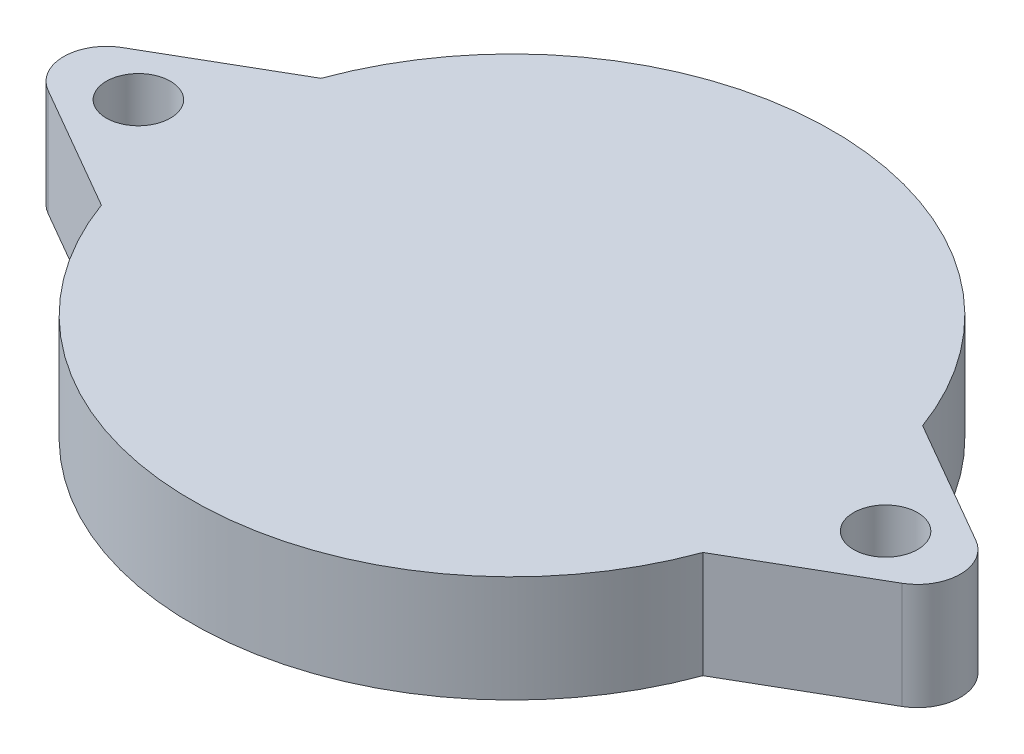
ISO-10303-21;
HEADER;
FILE_DESCRIPTION(('STEP AP214'),'2;1');
FILE_NAME('part.step','',(''),(''),'','','');
FILE_SCHEMA(('AUTOMOTIVE_DESIGN { 1 0 10303 214 1 1 1 1 }'));
ENDSEC;
DATA;
#1=APPLICATION_CONTEXT('core data for automotive mechanical design processes');
#2=APPLICATION_PROTOCOL_DEFINITION('international standard','automotive_design',2000,#1);
#3=PRODUCT_CONTEXT('',#1,'mechanical');
#4=PRODUCT('Part','Part','',(#3));
#5=PRODUCT_RELATED_PRODUCT_CATEGORY('part','',(#4));
#6=PRODUCT_DEFINITION_FORMATION('','',#4);
#7=PRODUCT_DEFINITION_CONTEXT('part definition',#1,'design');
#8=PRODUCT_DEFINITION('design','',#6,#7);
#9=PRODUCT_DEFINITION_SHAPE('','',#8);
#10=(LENGTH_UNIT() NAMED_UNIT(*) SI_UNIT(.MILLI.,.METRE.));
#11=(NAMED_UNIT(*) PLANE_ANGLE_UNIT() SI_UNIT($,.RADIAN.));
#12=(NAMED_UNIT(*) SI_UNIT($,.STERADIAN.) SOLID_ANGLE_UNIT());
#13=UNCERTAINTY_MEASURE_WITH_UNIT(LENGTH_MEASURE(1.E-05),#10,'distance_accuracy_value','');
#14=(GEOMETRIC_REPRESENTATION_CONTEXT(3) GLOBAL_UNCERTAINTY_ASSIGNED_CONTEXT((#13)) GLOBAL_UNIT_ASSIGNED_CONTEXT((#10,
#11,#12)) REPRESENTATION_CONTEXT('',''));
#15=CARTESIAN_POINT('',(0.,0.,0.));
#16=DIRECTION('',(0.,0.,1.));
#17=DIRECTION('',(1.,0.,0.));
#18=AXIS2_PLACEMENT_3D('',#15,#16,#17);
#19=CARTESIAN_POINT('',(0.,5.,0.));
#20=DIRECTION('',(0.,-1.,0.));
#21=DIRECTION('',(0.,0.,-1.));
#22=AXIS2_PLACEMENT_3D('',#19,#20,#21);
#23=CYLINDRICAL_SURFACE('',#22,15.);
#24=CARTESIAN_POINT('',(0.,0.,0.));
#25=DIRECTION('',(0.,1.,0.));
#26=DIRECTION('',(0.,0.,1.));
#27=AXIS2_PLACEMENT_3D('',#24,#25,#26);
#28=CIRCLE('',#27,15.);
#29=CARTESIAN_POINT('',(-14.0904136588062,0.,5.14395207245649));
#30=VERTEX_POINT('',#29);
#31=CARTESIAN_POINT('',(14.0904136588062,0.,5.14395207245648));
#32=VERTEX_POINT('',#31);
#33=EDGE_CURVE('E141',#30,#32,#28,.T.);
#34=ORIENTED_EDGE('',*,*,#33,.T.);
#35=DIRECTION('',(0.,-1.,0.));
#36=VECTOR('',#35,1.);
#37=CARTESIAN_POINT('',(14.0904136588062,5.,5.14395207245648));
#38=LINE('',#37,#36);
#39=CARTESIAN_POINT('',(14.0904136588062,5.,5.14395207245648));
#40=VERTEX_POINT('',#39);
#41=EDGE_CURVE('E11',#40,#32,#38,.T.);
#42=ORIENTED_EDGE('',*,*,#41,.F.);
#43=CARTESIAN_POINT('',(0.,5.,0.));
#44=DIRECTION('',(0.,1.,0.));
#45=DIRECTION('',(0.,0.,1.));
#46=AXIS2_PLACEMENT_3D('',#43,#44,#45);
#47=CIRCLE('',#46,15.);
#48=CARTESIAN_POINT('',(-14.0904136588062,5.,5.14395207245649));
#49=VERTEX_POINT('',#48);
#50=EDGE_CURVE('E165',#49,#40,#47,.T.);
#51=ORIENTED_EDGE('',*,*,#50,.F.);
#52=DIRECTION('',(0.,-1.,0.));
#53=VECTOR('',#52,1.);
#54=CARTESIAN_POINT('',(-14.0904136588062,5.,5.14395207245649));
#55=LINE('',#54,#53);
#56=EDGE_CURVE('E52',#49,#30,#55,.T.);
#57=ORIENTED_EDGE('',*,*,#56,.T.);
#58=EDGE_LOOP('',(#34,#42,#51,#57));
#59=FACE_BOUND('',#58,.T.);
#60=ADVANCED_FACE('F35',(#59),#23,.T.);
#61=CARTESIAN_POINT('',(5.74999999999998,5.,9.95929214352105));
#62=DIRECTION('',(-0.499999999999999,0.,-0.866025403784439));
#63=DIRECTION('',(-0.866025403784439,0.,0.499999999999999));
#64=AXIS2_PLACEMENT_3D('',#61,#62,#63);
#65=PLANE('',#64);
#66=DIRECTION('',(0.866025403784439,0.,-0.499999999999999));
#67=VECTOR('',#66,1.);
#68=CARTESIAN_POINT('',(5.74999999999998,0.,9.95929214352105));
#69=LINE('',#68,#67);
#70=CARTESIAN_POINT('',(20.,0.,1.73205080756888));
#71=VERTEX_POINT('',#70);
#72=EDGE_CURVE('E143',#32,#71,#69,.T.);
#73=ORIENTED_EDGE('',*,*,#72,.T.);
#74=DIRECTION('',(0.,-1.,0.));
#75=VECTOR('',#74,1.);
#76=CARTESIAN_POINT('',(20.,5.,1.73205080756888));
#77=LINE('',#76,#75);
#78=CARTESIAN_POINT('',(20.,5.,1.73205080756888));
#79=VERTEX_POINT('',#78);
#80=EDGE_CURVE('E44',#79,#71,#77,.T.);
#81=ORIENTED_EDGE('',*,*,#80,.F.);
#82=DIRECTION('',(0.866025403784439,0.,-0.499999999999999));
#83=VECTOR('',#82,1.);
#84=CARTESIAN_POINT('',(5.74999999999998,5.,9.95929214352105));
#85=LINE('',#84,#83);
#86=EDGE_CURVE('E91',#40,#79,#85,.T.);
#87=ORIENTED_EDGE('',*,*,#86,.F.);
#88=ORIENTED_EDGE('',*,*,#41,.T.);
#89=EDGE_LOOP('',(#73,#81,#87,#88));
#90=FACE_BOUND('',#89,.T.);
#91=ADVANCED_FACE('F37',(#90),#65,.F.);
#92=CARTESIAN_POINT('',(19.,5.,0.));
#93=DIRECTION('',(0.,-1.,0.));
#94=DIRECTION('',(0.,0.,-1.));
#95=AXIS2_PLACEMENT_3D('',#92,#93,#94);
#96=CYLINDRICAL_SURFACE('',#95,2.00000000000001);
#97=CARTESIAN_POINT('',(19.,0.,0.));
#98=DIRECTION('',(0.,1.,0.));
#99=DIRECTION('',(0.,0.,1.));
#100=AXIS2_PLACEMENT_3D('',#97,#98,#99);
#101=CIRCLE('',#100,2.00000000000001);
#102=CARTESIAN_POINT('',(20.,0.,-1.73205080756888));
#103=VERTEX_POINT('',#102);
#104=EDGE_CURVE('E147',#103,#71,#101,.F.);
#105=ORIENTED_EDGE('',*,*,#104,.F.);
#106=DIRECTION('',(0.,-1.,0.));
#107=VECTOR('',#106,1.);
#108=CARTESIAN_POINT('',(20.,5.,-1.73205080756888));
#109=LINE('',#108,#107);
#110=CARTESIAN_POINT('',(20.,5.,-1.73205080756888));
#111=VERTEX_POINT('',#110);
#112=EDGE_CURVE('E171',#111,#103,#109,.T.);
#113=ORIENTED_EDGE('',*,*,#112,.F.);
#114=CARTESIAN_POINT('',(19.,5.,0.));
#115=DIRECTION('',(0.,1.,0.));
#116=DIRECTION('',(0.,0.,1.));
#117=AXIS2_PLACEMENT_3D('',#114,#115,#116);
#118=CIRCLE('',#117,2.00000000000001);
#119=EDGE_CURVE('E177',#111,#79,#118,.F.);
#120=ORIENTED_EDGE('',*,*,#119,.T.);
#121=ORIENTED_EDGE('',*,*,#80,.T.);
#122=EDGE_LOOP('',(#105,#113,#120,#121));
#123=FACE_BOUND('',#122,.T.);
#124=ADVANCED_FACE('F175',(#123),#96,.T.);
#125=CARTESIAN_POINT('',(5.74999999999998,5.,-9.95929214352105));
#126=DIRECTION('',(0.499999999999999,0.,-0.866025403784439));
#127=DIRECTION('',(-0.866025403784439,0.,-0.499999999999999));
#128=AXIS2_PLACEMENT_3D('',#125,#126,#127);
#129=PLANE('',#128);
#130=DIRECTION('',(0.866025403784439,0.,0.499999999999999));
#131=VECTOR('',#130,1.);
#132=CARTESIAN_POINT('',(5.74999999999998,0.,-9.95929214352105));
#133=LINE('',#132,#131);
#134=CARTESIAN_POINT('',(14.0904136588062,0.,-5.14395207245648));
#135=VERTEX_POINT('',#134);
#136=EDGE_CURVE('E150',#135,#103,#133,.T.);
#137=ORIENTED_EDGE('',*,*,#136,.F.);
#138=DIRECTION('',(0.,-1.,0.));
#139=VECTOR('',#138,1.);
#140=CARTESIAN_POINT('',(14.0904136588062,5.,-5.14395207245648));
#141=LINE('',#140,#139);
#142=CARTESIAN_POINT('',(14.0904136588062,5.,-5.14395207245648));
#143=VERTEX_POINT('',#142);
#144=EDGE_CURVE('E169',#143,#135,#141,.T.);
#145=ORIENTED_EDGE('',*,*,#144,.F.);
#146=DIRECTION('',(0.866025403784439,0.,0.499999999999999));
#147=VECTOR('',#146,1.);
#148=CARTESIAN_POINT('',(5.74999999999998,5.,-9.95929214352105));
#149=LINE('',#148,#147);
#150=EDGE_CURVE('E187',#143,#111,#149,.T.);
#151=ORIENTED_EDGE('',*,*,#150,.T.);
#152=ORIENTED_EDGE('',*,*,#112,.T.);
#153=EDGE_LOOP('',(#137,#145,#151,#152));
#154=FACE_BOUND('',#153,.T.);
#155=ADVANCED_FACE('F185',(#154),#129,.T.);
#156=CARTESIAN_POINT('',(-14.0904136588062,0.,-5.14395207245649));
#157=VERTEX_POINT('',#156);
#158=EDGE_CURVE('E144',#135,#157,#28,.T.);
#159=ORIENTED_EDGE('',*,*,#158,.T.);
#160=DIRECTION('',(0.,-1.,0.));
#161=VECTOR('',#160,1.);
#162=CARTESIAN_POINT('',(-14.0904136588062,5.,-5.14395207245649));
#163=LINE('',#162,#161);
#164=CARTESIAN_POINT('',(-14.0904136588062,5.,-5.14395207245649));
#165=VERTEX_POINT('',#164);
#166=EDGE_CURVE('E127',#165,#157,#163,.T.);
#167=ORIENTED_EDGE('',*,*,#166,.F.);
#168=EDGE_CURVE('E115',#143,#165,#47,.T.);
#169=ORIENTED_EDGE('',*,*,#168,.F.);
#170=ORIENTED_EDGE('',*,*,#144,.T.);
#171=EDGE_LOOP('',(#159,#167,#169,#170));
#172=FACE_BOUND('',#171,.T.);
#173=ADVANCED_FACE('F207',(#172),#23,.T.);
#174=CARTESIAN_POINT('',(-5.74999999999999,5.,-9.95929214352104));
#175=DIRECTION('',(0.5,0.,0.866025403784439));
#176=DIRECTION('',(0.866025403784439,0.,-0.5));
#177=AXIS2_PLACEMENT_3D('',#174,#175,#176);
#178=PLANE('',#177);
#179=DIRECTION('',(-0.866025403784439,0.,0.5));
#180=VECTOR('',#179,1.);
#181=CARTESIAN_POINT('',(-5.74999999999999,0.,-9.95929214352104));
#182=LINE('',#181,#180);
#183=CARTESIAN_POINT('',(-20.,0.,-1.73205080756888));
#184=VERTEX_POINT('',#183);
#185=EDGE_CURVE('E124',#157,#184,#182,.T.);
#186=ORIENTED_EDGE('',*,*,#185,.T.);
#187=DIRECTION('',(0.,-1.,0.));
#188=VECTOR('',#187,1.);
#189=CARTESIAN_POINT('',(-20.,5.,-1.73205080756888));
#190=LINE('',#189,#188);
#191=CARTESIAN_POINT('',(-20.,5.,-1.73205080756888));
#192=VERTEX_POINT('',#191);
#193=EDGE_CURVE('E121',#192,#184,#190,.T.);
#194=ORIENTED_EDGE('',*,*,#193,.F.);
#195=DIRECTION('',(-0.866025403784439,0.,0.5));
#196=VECTOR('',#195,1.);
#197=CARTESIAN_POINT('',(-5.74999999999999,5.,-9.95929214352104));
#198=LINE('',#197,#196);
#199=EDGE_CURVE('E106',#165,#192,#198,.T.);
#200=ORIENTED_EDGE('',*,*,#199,.F.);
#201=ORIENTED_EDGE('',*,*,#166,.T.);
#202=EDGE_LOOP('',(#186,#194,#200,#201));
#203=FACE_BOUND('',#202,.T.);
#204=ADVANCED_FACE('F122',(#203),#178,.F.);
#205=CARTESIAN_POINT('',(-19.,5.,0.));
#206=DIRECTION('',(0.,-1.,0.));
#207=DIRECTION('',(0.,0.,-1.));
#208=AXIS2_PLACEMENT_3D('',#205,#206,#207);
#209=CYLINDRICAL_SURFACE('',#208,2.);
#210=CARTESIAN_POINT('',(-19.,0.,0.));
#211=DIRECTION('',(0.,1.,0.));
#212=DIRECTION('',(0.,0.,1.));
#213=AXIS2_PLACEMENT_3D('',#210,#211,#212);
#214=CIRCLE('',#213,2.);
#215=CARTESIAN_POINT('',(-20.,0.,1.73205080756888));
#216=VERTEX_POINT('',#215);
#217=EDGE_CURVE('E154',#184,#216,#214,.T.);
#218=ORIENTED_EDGE('',*,*,#217,.T.);
#219=DIRECTION('',(0.,-1.,0.));
#220=VECTOR('',#219,1.);
#221=CARTESIAN_POINT('',(-20.,5.,1.73205080756888));
#222=LINE('',#221,#220);
#223=CARTESIAN_POINT('',(-20.,5.,1.73205080756888));
#224=VERTEX_POINT('',#223);
#225=EDGE_CURVE('E79',#224,#216,#222,.T.);
#226=ORIENTED_EDGE('',*,*,#225,.F.);
#227=CARTESIAN_POINT('',(-19.,5.,0.));
#228=DIRECTION('',(0.,1.,0.));
#229=DIRECTION('',(0.,0.,1.));
#230=AXIS2_PLACEMENT_3D('',#227,#228,#229);
#231=CIRCLE('',#230,2.);
#232=EDGE_CURVE('E112',#192,#224,#231,.T.);
#233=ORIENTED_EDGE('',*,*,#232,.F.);
#234=ORIENTED_EDGE('',*,*,#193,.T.);
#235=EDGE_LOOP('',(#218,#226,#233,#234));
#236=FACE_BOUND('',#235,.T.);
#237=ADVANCED_FACE('F129',(#236),#209,.T.);
#238=CARTESIAN_POINT('',(-17.5,5.,0.));
#239=DIRECTION('',(0.,-1.,0.));
#240=DIRECTION('',(0.,0.,-1.));
#241=AXIS2_PLACEMENT_3D('',#238,#239,#240);
#242=CYLINDRICAL_SURFACE('',#241,1.5);
#243=CARTESIAN_POINT('',(-17.5,5.,0.));
#244=DIRECTION('',(0.,1.,0.));
#245=DIRECTION('',(0.,0.,1.));
#246=AXIS2_PLACEMENT_3D('',#243,#244,#245);
#247=CIRCLE('',#246,1.5);
#248=CARTESIAN_POINT('',(-17.5,5.,1.5));
#249=VERTEX_POINT('',#248);
#250=EDGE_CURVE('E132',#249,#249,#247,.T.);
#251=ORIENTED_EDGE('',*,*,#250,.T.);
#252=EDGE_LOOP('',(#251));
#253=FACE_BOUND('',#252,.T.);
#254=CARTESIAN_POINT('',(-17.5,0.,0.));
#255=DIRECTION('',(0.,1.,0.));
#256=DIRECTION('',(0.,0.,1.));
#257=AXIS2_PLACEMENT_3D('',#254,#255,#256);
#258=CIRCLE('',#257,1.5);
#259=CARTESIAN_POINT('',(-17.5,0.,1.5));
#260=VERTEX_POINT('',#259);
#261=EDGE_CURVE('E159',#260,#260,#258,.T.);
#262=ORIENTED_EDGE('',*,*,#261,.F.);
#263=EDGE_LOOP('',(#262));
#264=FACE_BOUND('',#263,.T.);
#265=ADVANCED_FACE('F194',(#253,#264),#242,.F.);
#266=CARTESIAN_POINT('',(-5.74999999999999,5.,9.95929214352104));
#267=DIRECTION('',(-0.5,0.,0.866025403784439));
#268=DIRECTION('',(0.866025403784439,0.,0.5));
#269=AXIS2_PLACEMENT_3D('',#266,#267,#268);
#270=PLANE('',#269);
#271=DIRECTION('',(-0.866025403784439,0.,-0.5));
#272=VECTOR('',#271,1.);
#273=CARTESIAN_POINT('',(-5.74999999999999,0.,9.95929214352104));
#274=LINE('',#273,#272);
#275=EDGE_CURVE('E156',#30,#216,#274,.T.);
#276=ORIENTED_EDGE('',*,*,#275,.F.);
#277=ORIENTED_EDGE('',*,*,#56,.F.);
#278=DIRECTION('',(-0.866025403784439,0.,-0.5));
#279=VECTOR('',#278,1.);
#280=CARTESIAN_POINT('',(-5.74999999999999,5.,9.95929214352104));
#281=LINE('',#280,#279);
#282=EDGE_CURVE('E130',#49,#224,#281,.T.);
#283=ORIENTED_EDGE('',*,*,#282,.T.);
#284=ORIENTED_EDGE('',*,*,#225,.T.);
#285=EDGE_LOOP('',(#276,#277,#283,#284));
#286=FACE_BOUND('',#285,.T.);
#287=ADVANCED_FACE('F191',(#286),#270,.T.);
#288=CARTESIAN_POINT('',(17.5,5.,0.));
#289=DIRECTION('',(0.,-1.,0.));
#290=DIRECTION('',(0.,0.,-1.));
#291=AXIS2_PLACEMENT_3D('',#288,#289,#290);
#292=CYLINDRICAL_SURFACE('',#291,1.50000000000003);
#293=CARTESIAN_POINT('',(17.5,5.,0.));
#294=DIRECTION('',(0.,1.,0.));
#295=DIRECTION('',(0.,0.,1.));
#296=AXIS2_PLACEMENT_3D('',#293,#294,#295);
#297=CIRCLE('',#296,1.50000000000003);
#298=CARTESIAN_POINT('',(17.5,5.,1.50000000000002));
#299=VERTEX_POINT('',#298);
#300=EDGE_CURVE('E138',#299,#299,#297,.F.);
#301=ORIENTED_EDGE('',*,*,#300,.F.);
#302=EDGE_LOOP('',(#301));
#303=FACE_BOUND('',#302,.T.);
#304=CARTESIAN_POINT('',(17.5,0.,0.));
#305=DIRECTION('',(0.,1.,0.));
#306=DIRECTION('',(0.,0.,1.));
#307=AXIS2_PLACEMENT_3D('',#304,#305,#306);
#308=CIRCLE('',#307,1.50000000000003);
#309=CARTESIAN_POINT('',(17.5,0.,1.50000000000002));
#310=VERTEX_POINT('',#309);
#311=EDGE_CURVE('E162',#310,#310,#308,.F.);
#312=ORIENTED_EDGE('',*,*,#311,.T.);
#313=EDGE_LOOP('',(#312));
#314=FACE_BOUND('',#313,.T.);
#315=ADVANCED_FACE('F193',(#303,#314),#292,.F.);
#316=CARTESIAN_POINT('',(0.,5.,0.));
#317=DIRECTION('',(0.,1.,0.));
#318=DIRECTION('',(0.,0.,1.));
#319=AXIS2_PLACEMENT_3D('',#316,#317,#318);
#320=PLANE('',#319);
#321=ORIENTED_EDGE('',*,*,#50,.T.);
#322=ORIENTED_EDGE('',*,*,#86,.T.);
#323=ORIENTED_EDGE('',*,*,#119,.F.);
#324=ORIENTED_EDGE('',*,*,#150,.F.);
#325=ORIENTED_EDGE('',*,*,#168,.T.);
#326=ORIENTED_EDGE('',*,*,#199,.T.);
#327=ORIENTED_EDGE('',*,*,#232,.T.);
#328=ORIENTED_EDGE('',*,*,#282,.F.);
#329=EDGE_LOOP('',(#321,#322,#323,#324,#325,#326,#327,#328));
#330=FACE_BOUND('',#329,.T.);
#331=ORIENTED_EDGE('',*,*,#250,.F.);
#332=EDGE_LOOP('',(#331));
#333=FACE_BOUND('',#332,.T.);
#334=ORIENTED_EDGE('',*,*,#300,.T.);
#335=EDGE_LOOP('',(#334));
#336=FACE_BOUND('',#335,.T.);
#337=ADVANCED_FACE('F108',(#330,#333,#336),#320,.T.);
#338=CARTESIAN_POINT('',(0.,0.,0.));
#339=DIRECTION('',(0.,1.,0.));
#340=DIRECTION('',(0.,0.,1.));
#341=AXIS2_PLACEMENT_3D('',#338,#339,#340);
#342=PLANE('',#341);
#343=ORIENTED_EDGE('',*,*,#33,.F.);
#344=ORIENTED_EDGE('',*,*,#275,.T.);
#345=ORIENTED_EDGE('',*,*,#217,.F.);
#346=ORIENTED_EDGE('',*,*,#185,.F.);
#347=ORIENTED_EDGE('',*,*,#158,.F.);
#348=ORIENTED_EDGE('',*,*,#136,.T.);
#349=ORIENTED_EDGE('',*,*,#104,.T.);
#350=ORIENTED_EDGE('',*,*,#72,.F.);
#351=EDGE_LOOP('',(#343,#344,#345,#346,#347,#348,#349,#350));
#352=FACE_BOUND('',#351,.T.);
#353=ORIENTED_EDGE('',*,*,#261,.T.);
#354=EDGE_LOOP('',(#353));
#355=FACE_BOUND('',#354,.T.);
#356=ORIENTED_EDGE('',*,*,#311,.F.);
#357=EDGE_LOOP('',(#356));
#358=FACE_BOUND('',#357,.T.);
#359=ADVANCED_FACE('F180',(#352,#355,#358),#342,.F.);
#360=CLOSED_SHELL('',(#60,#91,#124,#155,#173,#204,#237,#265,#287,#315,#337,#359));
#361=MANIFOLD_SOLID_BREP('B2',#360);
#362=ADVANCED_BREP_SHAPE_REPRESENTATION('',(#18,#361),#14);
#363=SHAPE_DEFINITION_REPRESENTATION(#9,#362);
ENDSEC;
END-ISO-10303-21;
